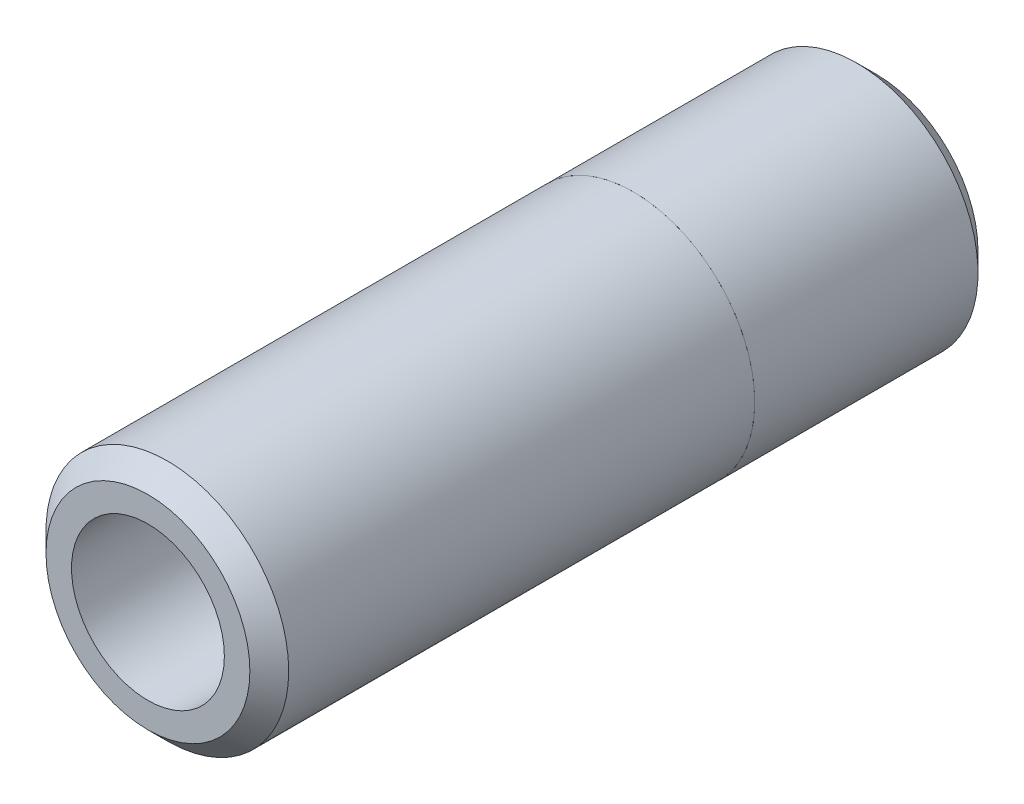
ISO-10303-21;
HEADER;
FILE_DESCRIPTION(('STEP AP214'),'2;1');
FILE_NAME('part.step','',(''),(''),'','','');
FILE_SCHEMA(('AUTOMOTIVE_DESIGN { 1 0 10303 214 1 1 1 1 }'));
ENDSEC;
DATA;
#1=APPLICATION_CONTEXT('core data for automotive mechanical design processes');
#2=APPLICATION_PROTOCOL_DEFINITION('international standard','automotive_design',2000,#1);
#3=PRODUCT_CONTEXT('',#1,'mechanical');
#4=PRODUCT('Part','Part','',(#3));
#5=PRODUCT_RELATED_PRODUCT_CATEGORY('part','',(#4));
#6=PRODUCT_DEFINITION_FORMATION('','',#4);
#7=PRODUCT_DEFINITION_CONTEXT('part definition',#1,'design');
#8=PRODUCT_DEFINITION('design','',#6,#7);
#9=PRODUCT_DEFINITION_SHAPE('','',#8);
#10=(LENGTH_UNIT() NAMED_UNIT(*) SI_UNIT(.MILLI.,.METRE.));
#11=(NAMED_UNIT(*) PLANE_ANGLE_UNIT() SI_UNIT($,.RADIAN.));
#12=(NAMED_UNIT(*) SI_UNIT($,.STERADIAN.) SOLID_ANGLE_UNIT());
#13=UNCERTAINTY_MEASURE_WITH_UNIT(LENGTH_MEASURE(1.E-05),#10,'distance_accuracy_value','');
#14=(GEOMETRIC_REPRESENTATION_CONTEXT(3) GLOBAL_UNCERTAINTY_ASSIGNED_CONTEXT((#13)) GLOBAL_UNIT_ASSIGNED_CONTEXT((#10,
#11,#12)) REPRESENTATION_CONTEXT('',''));
#15=CARTESIAN_POINT('',(0.,0.,0.));
#16=DIRECTION('',(0.,0.,1.));
#17=DIRECTION('',(1.,0.,0.));
#18=AXIS2_PLACEMENT_3D('',#15,#16,#17);
#19=CARTESIAN_POINT('',(0.,0.,-9.525));
#20=DIRECTION('',(0.,0.,1.));
#21=DIRECTION('',(1.,0.,0.));
#22=AXIS2_PLACEMENT_3D('',#19,#20,#21);
#23=CYLINDRICAL_SURFACE('',#22,4.7625);
#24=CARTESIAN_POINT('',(0.,0.,-8.76300000000001));
#25=DIRECTION('',(0.,0.,-1.));
#26=DIRECTION('',(-1.,0.,0.));
#27=AXIS2_PLACEMENT_3D('',#24,#25,#26);
#28=CIRCLE('',#27,4.7625);
#29=CARTESIAN_POINT('',(-4.7625,0.,-8.76300000000001));
#30=VERTEX_POINT('',#29);
#31=EDGE_CURVE('E12',#30,#30,#28,.F.);
#32=ORIENTED_EDGE('',*,*,#31,.T.);
#33=EDGE_LOOP('',(#32));
#34=FACE_BOUND('',#33,.T.);
#35=CARTESIAN_POINT('',(0.,0.,0.));
#36=DIRECTION('',(0.,0.,-1.));
#37=DIRECTION('',(-1.,0.,0.));
#38=AXIS2_PLACEMENT_3D('',#35,#36,#37);
#39=CIRCLE('',#38,4.7625);
#40=CARTESIAN_POINT('',(-4.7625,0.,0.));
#41=VERTEX_POINT('',#40);
#42=EDGE_CURVE('E64',#41,#41,#39,.T.);
#43=ORIENTED_EDGE('',*,*,#42,.T.);
#44=EDGE_LOOP('',(#43));
#45=FACE_BOUND('',#44,.T.);
#46=ADVANCED_FACE('F42',(#34,#45),#23,.T.);
#47=CARTESIAN_POINT('',(0.,0.,-9.525));
#48=DIRECTION('',(0.,0.,-1.));
#49=DIRECTION('',(-1.,0.,0.));
#50=AXIS2_PLACEMENT_3D('',#47,#48,#49);
#51=PLANE('',#50);
#52=CARTESIAN_POINT('',(0.,0.,-9.525));
#53=DIRECTION('',(0.,0.,-1.));
#54=DIRECTION('',(-1.,0.,0.));
#55=AXIS2_PLACEMENT_3D('',#52,#53,#54);
#56=CIRCLE('',#55,4.00050000000001);
#57=CARTESIAN_POINT('',(-4.00050000000001,0.,-9.525));
#58=VERTEX_POINT('',#57);
#59=EDGE_CURVE('E49',#58,#58,#56,.T.);
#60=ORIENTED_EDGE('',*,*,#59,.T.);
#61=EDGE_LOOP('',(#60));
#62=FACE_BOUND('',#61,.T.);
#63=ADVANCED_FACE('F71',(#62),#51,.T.);
#64=CARTESIAN_POINT('',(0.,0.,0.));
#65=DIRECTION('',(0.,0.,-1.));
#66=DIRECTION('',(-1.,0.,0.));
#67=AXIS2_PLACEMENT_3D('',#64,#65,#66);
#68=PLANE('',#67);
#69=CARTESIAN_POINT('',(0.,0.,0.));
#70=DIRECTION('',(0.,0.,-1.));
#71=DIRECTION('',(-1.,0.,0.));
#72=AXIS2_PLACEMENT_3D('',#69,#70,#71);
#73=CIRCLE('',#72,3.);
#74=CARTESIAN_POINT('',(-3.,0.,0.));
#75=VERTEX_POINT('',#74);
#76=EDGE_CURVE('E61',#75,#75,#73,.T.);
#77=ORIENTED_EDGE('',*,*,#76,.T.);
#78=EDGE_LOOP('',(#77));
#79=FACE_BOUND('',#78,.T.);
#80=ORIENTED_EDGE('',*,*,#42,.F.);
#81=EDGE_LOOP('',(#80));
#82=FACE_BOUND('',#81,.T.);
#83=ADVANCED_FACE('F84',(#79,#82),#68,.F.);
#84=CARTESIAN_POINT('',(0.,0.,19.05));
#85=DIRECTION('',(0.,0.,1.));
#86=DIRECTION('',(1.,0.,0.));
#87=AXIS2_PLACEMENT_3D('',#84,#85,#86);
#88=CYLINDRICAL_SURFACE('',#87,3.);
#89=CARTESIAN_POINT('',(0.,0.,-1.905));
#90=DIRECTION('',(0.,0.,1.));
#91=DIRECTION('',(1.,0.,0.));
#92=AXIS2_PLACEMENT_3D('',#89,#90,#91);
#93=CIRCLE('',#92,2.99999999999999);
#94=CARTESIAN_POINT('',(2.99999999999999,0.,-1.905));
#95=VERTEX_POINT('',#94);
#96=EDGE_CURVE('E59',#95,#95,#93,.T.);
#97=ORIENTED_EDGE('',*,*,#96,.F.);
#98=EDGE_LOOP('',(#97));
#99=FACE_BOUND('',#98,.T.);
#100=ORIENTED_EDGE('',*,*,#76,.F.);
#101=EDGE_LOOP('',(#100));
#102=FACE_BOUND('',#101,.T.);
#103=ADVANCED_FACE('F55',(#99,#102),#88,.F.);
#104=CARTESIAN_POINT('',(0.,0.,-1.905));
#105=DIRECTION('',(0.,0.,1.));
#106=DIRECTION('',(1.,0.,0.));
#107=AXIS2_PLACEMENT_3D('',#104,#105,#106);
#108=CONICAL_SURFACE('',#107,2.99999999999999,1.02974425867665);
#109=CARTESIAN_POINT('',(0.,0.,-3.70758185708268));
#110=VERTEX_POINT('',#109);
#111=VERTEX_LOOP('',#110);
#112=FACE_BOUND('',#111,.T.);
#113=ORIENTED_EDGE('',*,*,#96,.T.);
#114=EDGE_LOOP('',(#113));
#115=FACE_BOUND('',#114,.T.);
#116=ADVANCED_FACE('F52',(#112,#115),#108,.F.);
#117=CARTESIAN_POINT('',(0.,0.,-9.525));
#118=DIRECTION('',(0.,0.,1.));
#119=DIRECTION('',(1.,0.,0.));
#120=AXIS2_PLACEMENT_3D('',#117,#118,#119);
#121=CONICAL_SURFACE('',#120,4.00050000000001,0.785398163397447);
#122=ORIENTED_EDGE('',*,*,#31,.F.);
#123=EDGE_LOOP('',(#122));
#124=FACE_BOUND('',#123,.T.);
#125=ORIENTED_EDGE('',*,*,#59,.F.);
#126=EDGE_LOOP('',(#125));
#127=FACE_BOUND('',#126,.T.);
#128=ADVANCED_FACE('F44',(#124,#127),#121,.T.);
#129=CLOSED_SHELL('',(#46,#63,#83,#103,#116,#128));
#130=MANIFOLD_SOLID_BREP('B2',#129);
#131=CARTESIAN_POINT('',(0.,0.,19.05));
#132=DIRECTION('',(0.,0.,-1.));
#133=DIRECTION('',(-1.,0.,0.));
#134=AXIS2_PLACEMENT_3D('',#131,#132,#133);
#135=CYLINDRICAL_SURFACE('',#134,4.7625);
#136=CARTESIAN_POINT('',(0.,0.,18.288));
#137=DIRECTION('',(0.,0.,1.));
#138=DIRECTION('',(1.,0.,0.));
#139=AXIS2_PLACEMENT_3D('',#136,#137,#138);
#140=CIRCLE('',#139,4.7625);
#141=CARTESIAN_POINT('',(4.7625,0.,18.288));
#142=VERTEX_POINT('',#141);
#143=EDGE_CURVE('E41',#142,#142,#140,.F.);
#144=ORIENTED_EDGE('',*,*,#143,.T.);
#145=EDGE_LOOP('',(#144));
#146=FACE_BOUND('',#145,.T.);
#147=CARTESIAN_POINT('',(0.,0.,0.));
#148=DIRECTION('',(0.,0.,1.));
#149=DIRECTION('',(1.,0.,0.));
#150=AXIS2_PLACEMENT_3D('',#147,#148,#149);
#151=CIRCLE('',#150,4.7625);
#152=CARTESIAN_POINT('',(4.7625,0.,0.));
#153=VERTEX_POINT('',#152);
#154=EDGE_CURVE('E143',#153,#153,#151,.T.);
#155=ORIENTED_EDGE('',*,*,#154,.T.);
#156=EDGE_LOOP('',(#155));
#157=FACE_BOUND('',#156,.T.);
#158=ADVANCED_FACE('F132',(#146,#157),#135,.T.);
#159=CARTESIAN_POINT('',(0.,0.,19.05));
#160=DIRECTION('',(0.,0.,1.));
#161=DIRECTION('',(1.,0.,0.));
#162=AXIS2_PLACEMENT_3D('',#159,#160,#161);
#163=PLANE('',#162);
#164=CARTESIAN_POINT('',(0.,0.,19.05));
#165=DIRECTION('',(0.,0.,1.));
#166=DIRECTION('',(1.,0.,0.));
#167=AXIS2_PLACEMENT_3D('',#164,#165,#166);
#168=CIRCLE('',#167,4.00050000000002);
#169=CARTESIAN_POINT('',(4.00050000000002,0.,19.05));
#170=VERTEX_POINT('',#169);
#171=EDGE_CURVE('E139',#170,#170,#168,.T.);
#172=ORIENTED_EDGE('',*,*,#171,.T.);
#173=EDGE_LOOP('',(#172));
#174=FACE_BOUND('',#173,.T.);
#175=CARTESIAN_POINT('',(0.,0.,19.05));
#176=DIRECTION('',(0.,0.,1.));
#177=DIRECTION('',(1.,0.,0.));
#178=AXIS2_PLACEMENT_3D('',#175,#176,#177);
#179=CIRCLE('',#178,3.);
#180=CARTESIAN_POINT('',(3.,0.,19.05));
#181=VERTEX_POINT('',#180);
#182=EDGE_CURVE('E151',#181,#181,#179,.T.);
#183=ORIENTED_EDGE('',*,*,#182,.F.);
#184=EDGE_LOOP('',(#183));
#185=FACE_BOUND('',#184,.T.);
#186=ADVANCED_FACE('F159',(#174,#185),#163,.T.);
#187=CARTESIAN_POINT('',(0.,0.,0.));
#188=DIRECTION('',(0.,0.,1.));
#189=DIRECTION('',(1.,0.,0.));
#190=AXIS2_PLACEMENT_3D('',#187,#188,#189);
#191=PLANE('',#190);
#192=CARTESIAN_POINT('',(0.,0.,0.));
#193=DIRECTION('',(0.,0.,1.));
#194=DIRECTION('',(1.,0.,0.));
#195=AXIS2_PLACEMENT_3D('',#192,#193,#194);
#196=CIRCLE('',#195,3.);
#197=CARTESIAN_POINT('',(3.,0.,0.));
#198=VERTEX_POINT('',#197);
#199=EDGE_CURVE('E147',#198,#198,#196,.T.);
#200=ORIENTED_EDGE('',*,*,#199,.T.);
#201=EDGE_LOOP('',(#200));
#202=FACE_BOUND('',#201,.T.);
#203=ORIENTED_EDGE('',*,*,#154,.F.);
#204=EDGE_LOOP('',(#203));
#205=FACE_BOUND('',#204,.T.);
#206=ADVANCED_FACE('F161',(#202,#205),#191,.F.);
#207=CARTESIAN_POINT('',(0.,0.,19.05));
#208=DIRECTION('',(0.,0.,1.));
#209=DIRECTION('',(1.,0.,0.));
#210=AXIS2_PLACEMENT_3D('',#207,#208,#209);
#211=CYLINDRICAL_SURFACE('',#210,3.);
#212=ORIENTED_EDGE('',*,*,#182,.T.);
#213=EDGE_LOOP('',(#212));
#214=FACE_BOUND('',#213,.T.);
#215=ORIENTED_EDGE('',*,*,#199,.F.);
#216=EDGE_LOOP('',(#215));
#217=FACE_BOUND('',#216,.T.);
#218=ADVANCED_FACE('F156',(#214,#217),#211,.F.);
#219=CARTESIAN_POINT('',(0.,0.,19.05));
#220=DIRECTION('',(0.,0.,-1.));
#221=DIRECTION('',(-1.,0.,0.));
#222=AXIS2_PLACEMENT_3D('',#219,#220,#221);
#223=CONICAL_SURFACE('',#222,4.00050000000002,0.785398163397445);
#224=ORIENTED_EDGE('',*,*,#143,.F.);
#225=EDGE_LOOP('',(#224));
#226=FACE_BOUND('',#225,.T.);
#227=ORIENTED_EDGE('',*,*,#171,.F.);
#228=EDGE_LOOP('',(#227));
#229=FACE_BOUND('',#228,.T.);
#230=ADVANCED_FACE('F134',(#226,#229),#223,.T.);
#231=CLOSED_SHELL('',(#158,#186,#206,#218,#230));
#232=MANIFOLD_SOLID_BREP('B6',#231);
#233=ADVANCED_BREP_SHAPE_REPRESENTATION('',(#18,#130,#232),#14);
#234=SHAPE_DEFINITION_REPRESENTATION(#9,#233);
ENDSEC;
END-ISO-10303-21;
